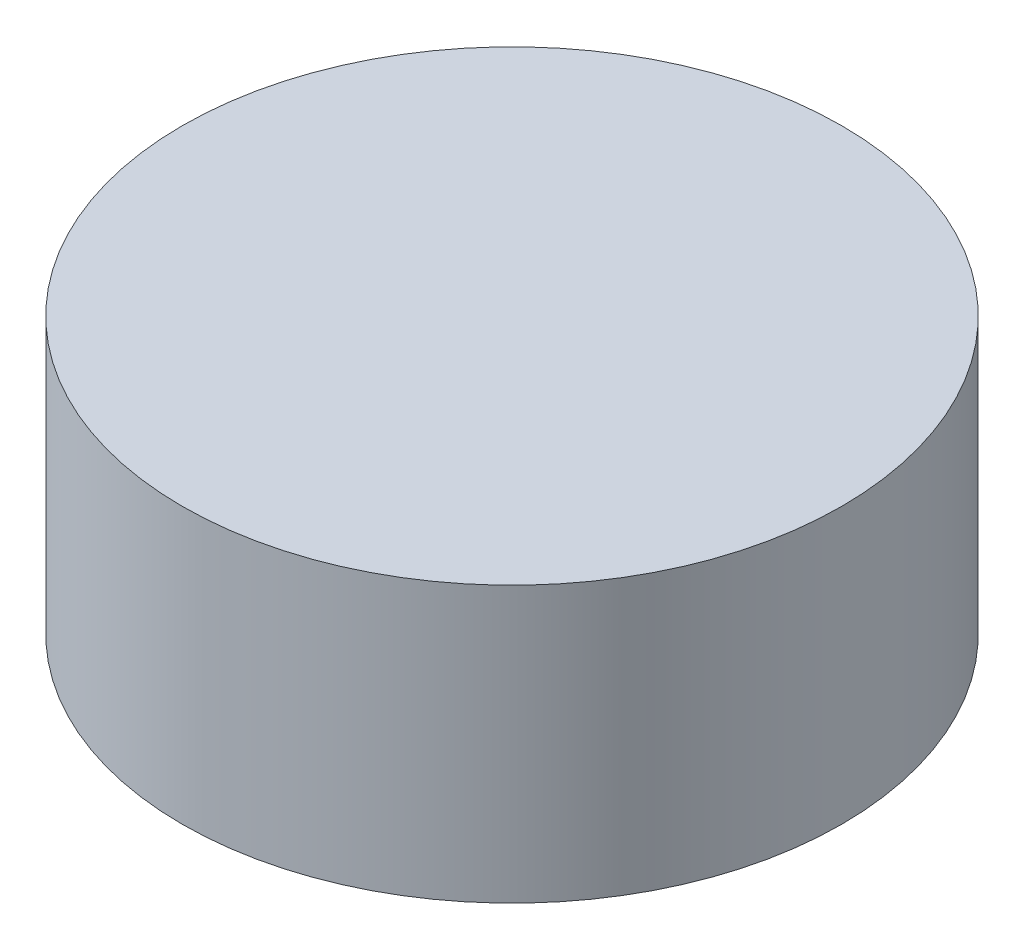
ISO-10303-21;
HEADER;
FILE_DESCRIPTION(('STEP AP214'),'2;1');
FILE_NAME('part.step','',(''),(''),'','','');
FILE_SCHEMA(('AUTOMOTIVE_DESIGN { 1 0 10303 214 1 1 1 1 }'));
ENDSEC;
DATA;
#1=APPLICATION_CONTEXT('core data for automotive mechanical design processes');
#2=APPLICATION_PROTOCOL_DEFINITION('international standard','automotive_design',2000,#1);
#3=PRODUCT_CONTEXT('',#1,'mechanical');
#4=PRODUCT('Part','Part','',(#3));
#5=PRODUCT_RELATED_PRODUCT_CATEGORY('part','',(#4));
#6=PRODUCT_DEFINITION_FORMATION('','',#4);
#7=PRODUCT_DEFINITION_CONTEXT('part definition',#1,'design');
#8=PRODUCT_DEFINITION('design','',#6,#7);
#9=PRODUCT_DEFINITION_SHAPE('','',#8);
#10=(LENGTH_UNIT() NAMED_UNIT(*) SI_UNIT(.MILLI.,.METRE.));
#11=(NAMED_UNIT(*) PLANE_ANGLE_UNIT() SI_UNIT($,.RADIAN.));
#12=(NAMED_UNIT(*) SI_UNIT($,.STERADIAN.) SOLID_ANGLE_UNIT());
#13=UNCERTAINTY_MEASURE_WITH_UNIT(LENGTH_MEASURE(1.E-05),#10,'distance_accuracy_value','');
#14=(GEOMETRIC_REPRESENTATION_CONTEXT(3) GLOBAL_UNCERTAINTY_ASSIGNED_CONTEXT((#13)) GLOBAL_UNIT_ASSIGNED_CONTEXT((#10,
#11,#12)) REPRESENTATION_CONTEXT('',''));
#15=CARTESIAN_POINT('',(0.,0.,0.));
#16=DIRECTION('',(0.,0.,1.));
#17=DIRECTION('',(1.,0.,0.));
#18=AXIS2_PLACEMENT_3D('',#15,#16,#17);
#19=CARTESIAN_POINT('',(0.,10.,0.));
#20=DIRECTION('',(0.,-1.,0.));
#21=DIRECTION('',(0.,0.,-1.));
#22=AXIS2_PLACEMENT_3D('',#19,#20,#21);
#23=CYLINDRICAL_SURFACE('',#22,23.9466303815871);
#24=CARTESIAN_POINT('',(0.,10.,0.));
#25=DIRECTION('',(0.,1.,0.));
#26=DIRECTION('',(0.,0.,1.));
#27=AXIS2_PLACEMENT_3D('',#24,#25,#26);
#28=CIRCLE('',#27,23.9466303815871);
#29=CARTESIAN_POINT('',(0.,10.,23.9466303815871));
#30=VERTEX_POINT('',#29);
#31=EDGE_CURVE('E10',#30,#30,#28,.T.);
#32=ORIENTED_EDGE('',*,*,#31,.F.);
#33=EDGE_LOOP('',(#32));
#34=FACE_BOUND('',#33,.T.);
#35=CARTESIAN_POINT('',(0.,-10.,0.));
#36=DIRECTION('',(0.,1.,0.));
#37=DIRECTION('',(0.,0.,1.));
#38=AXIS2_PLACEMENT_3D('',#35,#36,#37);
#39=CIRCLE('',#38,23.9466303815871);
#40=CARTESIAN_POINT('',(0.,-10.,23.9466303815871));
#41=VERTEX_POINT('',#40);
#42=EDGE_CURVE('E34',#41,#41,#39,.T.);
#43=ORIENTED_EDGE('',*,*,#42,.T.);
#44=EDGE_LOOP('',(#43));
#45=FACE_BOUND('',#44,.T.);
#46=ADVANCED_FACE('F31',(#34,#45),#23,.T.);
#47=CARTESIAN_POINT('',(0.,10.,0.));
#48=DIRECTION('',(0.,1.,0.));
#49=DIRECTION('',(0.,0.,1.));
#50=AXIS2_PLACEMENT_3D('',#47,#48,#49);
#51=PLANE('',#50);
#52=ORIENTED_EDGE('',*,*,#31,.T.);
#53=EDGE_LOOP('',(#52));
#54=FACE_BOUND('',#53,.T.);
#55=ADVANCED_FACE('F46',(#54),#51,.T.);
#56=CARTESIAN_POINT('',(0.,-10.,0.));
#57=DIRECTION('',(0.,1.,0.));
#58=DIRECTION('',(0.,0.,1.));
#59=AXIS2_PLACEMENT_3D('',#56,#57,#58);
#60=PLANE('',#59);
#61=ORIENTED_EDGE('',*,*,#42,.F.);
#62=EDGE_LOOP('',(#61));
#63=FACE_BOUND('',#62,.T.);
#64=ADVANCED_FACE('F44',(#63),#60,.F.);
#65=CLOSED_SHELL('',(#46,#55,#64));
#66=MANIFOLD_SOLID_BREP('B2',#65);
#67=ADVANCED_BREP_SHAPE_REPRESENTATION('',(#18,#66),#14);
#68=SHAPE_DEFINITION_REPRESENTATION(#9,#67);
ENDSEC;
END-ISO-10303-21;
